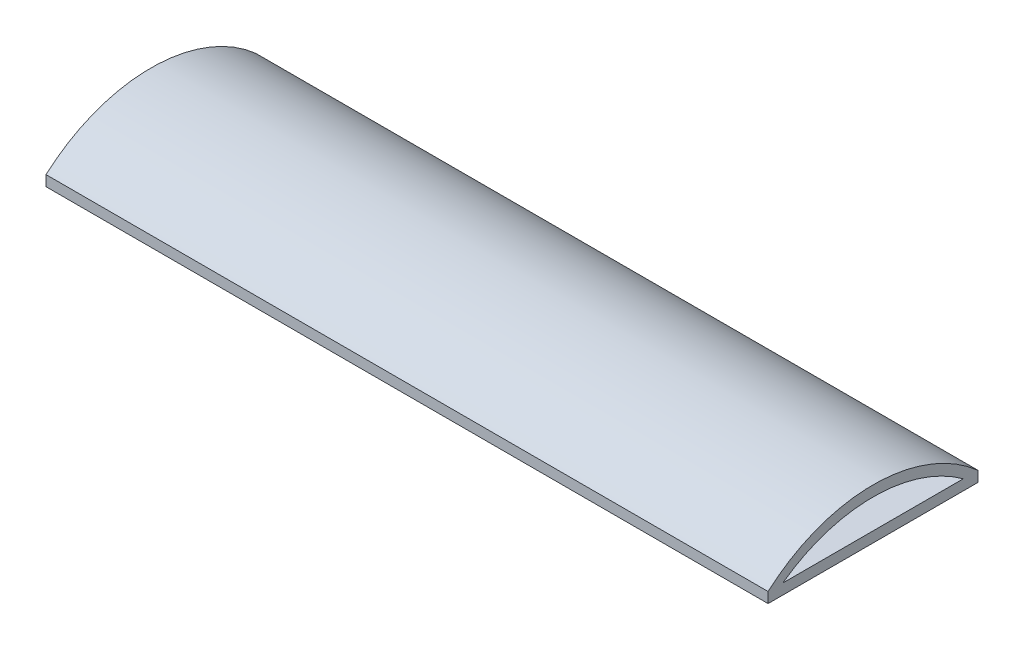
ISO-10303-21;
HEADER;
FILE_DESCRIPTION(('STEP AP214'),'2;1');
FILE_NAME('part.step','',(''),(''),'','','');
FILE_SCHEMA(('AUTOMOTIVE_DESIGN { 1 0 10303 214 1 1 1 1 }'));
ENDSEC;
DATA;
#1=APPLICATION_CONTEXT('core data for automotive mechanical design processes');
#2=APPLICATION_PROTOCOL_DEFINITION('international standard','automotive_design',2000,#1);
#3=PRODUCT_CONTEXT('',#1,'mechanical');
#4=PRODUCT('Part','Part','',(#3));
#5=PRODUCT_RELATED_PRODUCT_CATEGORY('part','',(#4));
#6=PRODUCT_DEFINITION_FORMATION('','',#4);
#7=PRODUCT_DEFINITION_CONTEXT('part definition',#1,'design');
#8=PRODUCT_DEFINITION('design','',#6,#7);
#9=PRODUCT_DEFINITION_SHAPE('','',#8);
#10=(LENGTH_UNIT() NAMED_UNIT(*) SI_UNIT(.MILLI.,.METRE.));
#11=(NAMED_UNIT(*) PLANE_ANGLE_UNIT() SI_UNIT($,.RADIAN.));
#12=(NAMED_UNIT(*) SI_UNIT($,.STERADIAN.) SOLID_ANGLE_UNIT());
#13=UNCERTAINTY_MEASURE_WITH_UNIT(LENGTH_MEASURE(1.E-05),#10,'distance_accuracy_value','');
#14=(GEOMETRIC_REPRESENTATION_CONTEXT(3) GLOBAL_UNCERTAINTY_ASSIGNED_CONTEXT((#13)) GLOBAL_UNIT_ASSIGNED_CONTEXT((#10,
#11,#12)) REPRESENTATION_CONTEXT('',''));
#15=CARTESIAN_POINT('',(0.,0.,0.));
#16=DIRECTION('',(0.,0.,1.));
#17=DIRECTION('',(1.,0.,0.));
#18=AXIS2_PLACEMENT_3D('',#15,#16,#17);
#19=CARTESIAN_POINT('',(-17.2,0.5,-5.));
#20=DIRECTION('',(1.,0.,0.));
#21=DIRECTION('',(0.,0.,-1.));
#22=AXIS2_PLACEMENT_3D('',#19,#20,#21);
#23=PLANE('',#22);
#24=CARTESIAN_POINT('',(-17.2,-5.40357142857143,0.));
#25=DIRECTION('',(-1.,0.,0.));
#26=DIRECTION('',(0.,0.,1.));
#27=AXIS2_PLACEMENT_3D('',#24,#25,#26);
#28=CIRCLE('',#27,7.30357142857143);
#29=CARTESIAN_POINT('',(-17.2,0.5,-4.3));
#30=VERTEX_POINT('',#29);
#31=CARTESIAN_POINT('',(-17.2,0.5,4.3));
#32=VERTEX_POINT('',#31);
#33=EDGE_CURVE('E90',#30,#32,#28,.F.);
#34=ORIENTED_EDGE('',*,*,#33,.T.);
#35=DIRECTION('',(0.,0.,1.));
#36=VECTOR('',#35,1.);
#37=CARTESIAN_POINT('',(-17.2,0.5,-5.));
#38=LINE('',#37,#36);
#39=EDGE_CURVE('E87',#30,#32,#38,.T.);
#40=ORIENTED_EDGE('',*,*,#39,.F.);
#41=EDGE_LOOP('',(#34,#40));
#42=FACE_BOUND('',#41,.T.);
#43=DIRECTION('',(0.,0.,1.));
#44=VECTOR('',#43,1.);
#45=CARTESIAN_POINT('',(-17.2,0.,-5.));
#46=LINE('',#45,#44);
#47=CARTESIAN_POINT('',(-17.2,0.,-5.));
#48=VERTEX_POINT('',#47);
#49=CARTESIAN_POINT('',(-17.2,0.,5.));
#50=VERTEX_POINT('',#49);
#51=EDGE_CURVE('E110',#48,#50,#46,.T.);
#52=ORIENTED_EDGE('',*,*,#51,.T.);
#53=DIRECTION('',(0.,-1.,0.));
#54=VECTOR('',#53,1.);
#55=CARTESIAN_POINT('',(-17.2,0.5,5.));
#56=LINE('',#55,#54);
#57=CARTESIAN_POINT('',(-17.2,0.5,5.));
#58=VERTEX_POINT('',#57);
#59=EDGE_CURVE('E11',#58,#50,#56,.T.);
#60=ORIENTED_EDGE('',*,*,#59,.F.);
#61=CARTESIAN_POINT('',(-17.2,-5.12503407263819,0.));
#62=DIRECTION('',(-1.,0.,0.));
#63=DIRECTION('',(0.,0.,1.));
#64=AXIS2_PLACEMENT_3D('',#61,#62,#63);
#65=CIRCLE('',#64,7.52602207798652);
#66=CARTESIAN_POINT('',(-17.2,0.5,-5.));
#67=VERTEX_POINT('',#66);
#68=EDGE_CURVE('E102',#67,#58,#65,.F.);
#69=ORIENTED_EDGE('',*,*,#68,.F.);
#70=DIRECTION('',(0.,-1.,0.));
#71=VECTOR('',#70,1.);
#72=CARTESIAN_POINT('',(-17.2,0.5,-5.));
#73=LINE('',#72,#71);
#74=EDGE_CURVE('E118',#67,#48,#73,.T.);
#75=ORIENTED_EDGE('',*,*,#74,.T.);
#76=EDGE_LOOP('',(#52,#60,#69,#75));
#77=FACE_BOUND('',#76,.T.);
#78=ADVANCED_FACE('F37',(#42,#77),#23,.F.);
#79=CARTESIAN_POINT('',(17.2,0.5,5.));
#80=DIRECTION('',(0.,0.,-1.));
#81=DIRECTION('',(-1.,0.,0.));
#82=AXIS2_PLACEMENT_3D('',#79,#80,#81);
#83=PLANE('',#82);
#84=DIRECTION('',(1.,0.,0.));
#85=VECTOR('',#84,1.);
#86=CARTESIAN_POINT('',(17.2,0.,5.));
#87=LINE('',#86,#85);
#88=CARTESIAN_POINT('',(17.2,0.,5.));
#89=VERTEX_POINT('',#88);
#90=EDGE_CURVE('E121',#50,#89,#87,.T.);
#91=ORIENTED_EDGE('',*,*,#90,.T.);
#92=DIRECTION('',(0.,-1.,0.));
#93=VECTOR('',#92,1.);
#94=CARTESIAN_POINT('',(17.2,0.5,5.));
#95=LINE('',#94,#93);
#96=CARTESIAN_POINT('',(17.2,0.5,5.));
#97=VERTEX_POINT('',#96);
#98=EDGE_CURVE('E44',#97,#89,#95,.T.);
#99=ORIENTED_EDGE('',*,*,#98,.F.);
#100=DIRECTION('',(1.,0.,0.));
#101=VECTOR('',#100,1.);
#102=CARTESIAN_POINT('',(17.2,0.5,5.));
#103=LINE('',#102,#101);
#104=EDGE_CURVE('E91',#58,#97,#103,.T.);
#105=ORIENTED_EDGE('',*,*,#104,.F.);
#106=ORIENTED_EDGE('',*,*,#59,.T.);
#107=EDGE_LOOP('',(#91,#99,#105,#106));
#108=FACE_BOUND('',#107,.T.);
#109=ADVANCED_FACE('F150',(#108),#83,.F.);
#110=CARTESIAN_POINT('',(17.2,0.5,-5.));
#111=DIRECTION('',(-1.,0.,0.));
#112=DIRECTION('',(0.,0.,1.));
#113=AXIS2_PLACEMENT_3D('',#110,#111,#112);
#114=PLANE('',#113);
#115=DIRECTION('',(0.,0.,-1.));
#116=VECTOR('',#115,1.);
#117=CARTESIAN_POINT('',(17.2,0.5,-5.));
#118=LINE('',#117,#116);
#119=CARTESIAN_POINT('',(17.2,0.5,4.3));
#120=VERTEX_POINT('',#119);
#121=CARTESIAN_POINT('',(17.2,0.5,-4.3));
#122=VERTEX_POINT('',#121);
#123=EDGE_CURVE('E51',#120,#122,#118,.T.);
#124=ORIENTED_EDGE('',*,*,#123,.F.);
#125=CARTESIAN_POINT('',(17.2,-5.40357142857143,0.));
#126=DIRECTION('',(-1.,0.,0.));
#127=DIRECTION('',(0.,0.,1.));
#128=AXIS2_PLACEMENT_3D('',#125,#126,#127);
#129=CIRCLE('',#128,7.30357142857143);
#130=EDGE_CURVE('E105',#122,#120,#129,.F.);
#131=ORIENTED_EDGE('',*,*,#130,.F.);
#132=EDGE_LOOP('',(#124,#131));
#133=FACE_BOUND('',#132,.T.);
#134=DIRECTION('',(0.,0.,-1.));
#135=VECTOR('',#134,1.);
#136=CARTESIAN_POINT('',(17.2,0.,-5.));
#137=LINE('',#136,#135);
#138=CARTESIAN_POINT('',(17.2,0.,-5.));
#139=VERTEX_POINT('',#138);
#140=EDGE_CURVE('E123',#89,#139,#137,.T.);
#141=ORIENTED_EDGE('',*,*,#140,.T.);
#142=DIRECTION('',(0.,-1.,0.));
#143=VECTOR('',#142,1.);
#144=CARTESIAN_POINT('',(17.2,0.5,-5.));
#145=LINE('',#144,#143);
#146=CARTESIAN_POINT('',(17.2,0.5,-5.));
#147=VERTEX_POINT('',#146);
#148=EDGE_CURVE('E128',#147,#139,#145,.T.);
#149=ORIENTED_EDGE('',*,*,#148,.F.);
#150=CARTESIAN_POINT('',(17.2,-5.12503407263819,0.));
#151=DIRECTION('',(-1.,0.,0.));
#152=DIRECTION('',(0.,0.,1.));
#153=AXIS2_PLACEMENT_3D('',#150,#151,#152);
#154=CIRCLE('',#153,7.52602207798652);
#155=EDGE_CURVE('E99',#147,#97,#154,.F.);
#156=ORIENTED_EDGE('',*,*,#155,.T.);
#157=ORIENTED_EDGE('',*,*,#98,.T.);
#158=EDGE_LOOP('',(#141,#149,#156,#157));
#159=FACE_BOUND('',#158,.T.);
#160=ADVANCED_FACE('F134',(#133,#159),#114,.F.);
#161=CARTESIAN_POINT('',(17.2,0.5,-5.));
#162=DIRECTION('',(0.,0.,1.));
#163=DIRECTION('',(1.,0.,0.));
#164=AXIS2_PLACEMENT_3D('',#161,#162,#163);
#165=PLANE('',#164);
#166=DIRECTION('',(-1.,0.,0.));
#167=VECTOR('',#166,1.);
#168=CARTESIAN_POINT('',(17.2,0.,-5.));
#169=LINE('',#168,#167);
#170=EDGE_CURVE('E92',#139,#48,#169,.T.);
#171=ORIENTED_EDGE('',*,*,#170,.T.);
#172=ORIENTED_EDGE('',*,*,#74,.F.);
#173=DIRECTION('',(-1.,0.,0.));
#174=VECTOR('',#173,1.);
#175=CARTESIAN_POINT('',(17.2,0.5,-5.));
#176=LINE('',#175,#174);
#177=EDGE_CURVE('E115',#147,#67,#176,.T.);
#178=ORIENTED_EDGE('',*,*,#177,.F.);
#179=ORIENTED_EDGE('',*,*,#148,.T.);
#180=EDGE_LOOP('',(#171,#172,#178,#179));
#181=FACE_BOUND('',#180,.T.);
#182=ADVANCED_FACE('F143',(#181),#165,.F.);
#183=CARTESIAN_POINT('',(0.,0.5,0.));
#184=DIRECTION('',(0.,-1.,0.));
#185=DIRECTION('',(0.,0.,-1.));
#186=AXIS2_PLACEMENT_3D('',#183,#184,#185);
#187=PLANE('',#186);
#188=ORIENTED_EDGE('',*,*,#39,.T.);
#189=DIRECTION('',(-1.,0.,0.));
#190=VECTOR('',#189,1.);
#191=CARTESIAN_POINT('',(17.2,0.5,4.3));
#192=LINE('',#191,#190);
#193=EDGE_CURVE('E56',#120,#32,#192,.T.);
#194=ORIENTED_EDGE('',*,*,#193,.F.);
#195=ORIENTED_EDGE('',*,*,#123,.T.);
#196=DIRECTION('',(-1.,0.,0.));
#197=VECTOR('',#196,1.);
#198=CARTESIAN_POINT('',(17.2,0.5,-4.3));
#199=LINE('',#198,#197);
#200=EDGE_CURVE('E94',#122,#30,#199,.T.);
#201=ORIENTED_EDGE('',*,*,#200,.T.);
#202=EDGE_LOOP('',(#188,#194,#195,#201));
#203=FACE_BOUND('',#202,.T.);
#204=ADVANCED_FACE('F95',(#203),#187,.F.);
#205=CARTESIAN_POINT('',(0.,0.,0.));
#206=DIRECTION('',(0.,-1.,0.));
#207=DIRECTION('',(0.,0.,-1.));
#208=AXIS2_PLACEMENT_3D('',#205,#206,#207);
#209=PLANE('',#208);
#210=ORIENTED_EDGE('',*,*,#51,.F.);
#211=ORIENTED_EDGE('',*,*,#170,.F.);
#212=ORIENTED_EDGE('',*,*,#140,.F.);
#213=ORIENTED_EDGE('',*,*,#90,.F.);
#214=EDGE_LOOP('',(#210,#211,#212,#213));
#215=FACE_BOUND('',#214,.T.);
#216=ADVANCED_FACE('F141',(#215),#209,.T.);
#217=CARTESIAN_POINT('',(17.2,-5.12503407263819,0.));
#218=DIRECTION('',(-1.,0.,0.));
#219=DIRECTION('',(0.,0.,1.));
#220=AXIS2_PLACEMENT_3D('',#217,#218,#219);
#221=CYLINDRICAL_SURFACE('',#220,7.52602207798652);
#222=ORIENTED_EDGE('',*,*,#68,.T.);
#223=ORIENTED_EDGE('',*,*,#104,.T.);
#224=ORIENTED_EDGE('',*,*,#155,.F.);
#225=ORIENTED_EDGE('',*,*,#177,.T.);
#226=EDGE_LOOP('',(#222,#223,#224,#225));
#227=FACE_BOUND('',#226,.T.);
#228=ADVANCED_FACE('F147',(#227),#221,.T.);
#229=CARTESIAN_POINT('',(17.2,-5.40357142857143,0.));
#230=DIRECTION('',(-1.,0.,0.));
#231=DIRECTION('',(0.,0.,1.));
#232=AXIS2_PLACEMENT_3D('',#229,#230,#231);
#233=CYLINDRICAL_SURFACE('',#232,7.30357142857143);
#234=ORIENTED_EDGE('',*,*,#33,.F.);
#235=ORIENTED_EDGE('',*,*,#200,.F.);
#236=ORIENTED_EDGE('',*,*,#130,.T.);
#237=ORIENTED_EDGE('',*,*,#193,.T.);
#238=EDGE_LOOP('',(#234,#235,#236,#237));
#239=FACE_BOUND('',#238,.T.);
#240=ADVANCED_FACE('F101',(#239),#233,.F.);
#241=CLOSED_SHELL('',(#78,#109,#160,#182,#204,#216,#228,#240));
#242=MANIFOLD_SOLID_BREP('B2',#241);
#243=ADVANCED_BREP_SHAPE_REPRESENTATION('',(#18,#242),#14);
#244=SHAPE_DEFINITION_REPRESENTATION(#9,#243);
ENDSEC;
END-ISO-10303-21;
